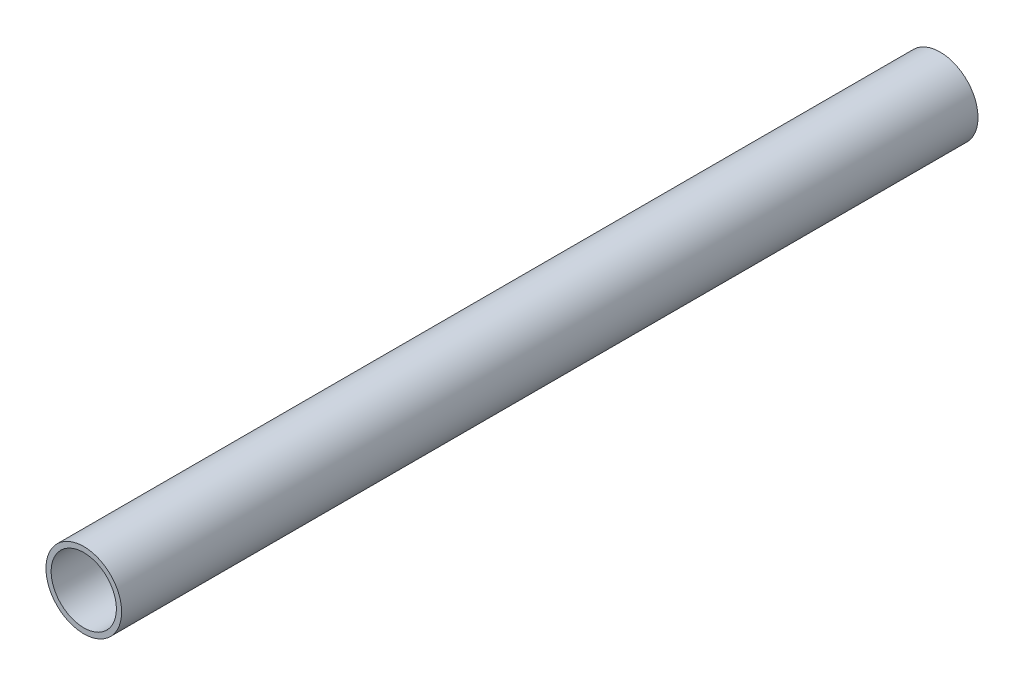
ISO-10303-21;
HEADER;
FILE_DESCRIPTION(('STEP AP214'),'2;1');
FILE_NAME('part.step','',(''),(''),'','','');
FILE_SCHEMA(('AUTOMOTIVE_DESIGN { 1 0 10303 214 1 1 1 1 }'));
ENDSEC;
DATA;
#1=APPLICATION_CONTEXT('core data for automotive mechanical design processes');
#2=APPLICATION_PROTOCOL_DEFINITION('international standard','automotive_design',2000,#1);
#3=PRODUCT_CONTEXT('',#1,'mechanical');
#4=PRODUCT('Part','Part','',(#3));
#5=PRODUCT_RELATED_PRODUCT_CATEGORY('part','',(#4));
#6=PRODUCT_DEFINITION_FORMATION('','',#4);
#7=PRODUCT_DEFINITION_CONTEXT('part definition',#1,'design');
#8=PRODUCT_DEFINITION('design','',#6,#7);
#9=PRODUCT_DEFINITION_SHAPE('','',#8);
#10=(LENGTH_UNIT() NAMED_UNIT(*) SI_UNIT(.MILLI.,.METRE.));
#11=(NAMED_UNIT(*) PLANE_ANGLE_UNIT() SI_UNIT($,.RADIAN.));
#12=(NAMED_UNIT(*) SI_UNIT($,.STERADIAN.) SOLID_ANGLE_UNIT());
#13=UNCERTAINTY_MEASURE_WITH_UNIT(LENGTH_MEASURE(1.E-05),#10,'distance_accuracy_value','');
#14=(GEOMETRIC_REPRESENTATION_CONTEXT(3) GLOBAL_UNCERTAINTY_ASSIGNED_CONTEXT((#13)) GLOBAL_UNIT_ASSIGNED_CONTEXT((#10,
#11,#12)) REPRESENTATION_CONTEXT('',''));
#15=CARTESIAN_POINT('',(0.,0.,0.));
#16=DIRECTION('',(0.,0.,1.));
#17=DIRECTION('',(1.,0.,0.));
#18=AXIS2_PLACEMENT_3D('',#15,#16,#17);
#19=CARTESIAN_POINT('',(0.,0.,101.6));
#20=DIRECTION('',(0.,0.,1.));
#21=DIRECTION('',(1.,0.,0.));
#22=AXIS2_PLACEMENT_3D('',#19,#20,#21);
#23=PLANE('',#22);
#24=CARTESIAN_POINT('',(0.,0.,101.6));
#25=DIRECTION('',(0.,0.,1.));
#26=DIRECTION('',(1.,0.,0.));
#27=AXIS2_PLACEMENT_3D('',#24,#25,#26);
#28=CIRCLE('',#27,4.49);
#29=CARTESIAN_POINT('',(4.49,0.,101.6));
#30=VERTEX_POINT('',#29);
#31=EDGE_CURVE('E10',#30,#30,#28,.T.);
#32=ORIENTED_EDGE('',*,*,#31,.T.);
#33=EDGE_LOOP('',(#32));
#34=FACE_BOUND('',#33,.T.);
#35=CARTESIAN_POINT('',(0.,0.,101.6));
#36=DIRECTION('',(0.,0.,1.));
#37=DIRECTION('',(1.,0.,0.));
#38=AXIS2_PLACEMENT_3D('',#35,#36,#37);
#39=CIRCLE('',#38,3.87);
#40=CARTESIAN_POINT('',(3.87,0.,101.6));
#41=VERTEX_POINT('',#40);
#42=EDGE_CURVE('E45',#41,#41,#39,.T.);
#43=ORIENTED_EDGE('',*,*,#42,.F.);
#44=EDGE_LOOP('',(#43));
#45=FACE_BOUND('',#44,.T.);
#46=ADVANCED_FACE('F34',(#34,#45),#23,.T.);
#47=CARTESIAN_POINT('',(0.,0.,0.));
#48=DIRECTION('',(0.,0.,1.));
#49=DIRECTION('',(1.,0.,0.));
#50=AXIS2_PLACEMENT_3D('',#47,#48,#49);
#51=PLANE('',#50);
#52=CARTESIAN_POINT('',(0.,0.,0.));
#53=DIRECTION('',(0.,0.,1.));
#54=DIRECTION('',(1.,0.,0.));
#55=AXIS2_PLACEMENT_3D('',#52,#53,#54);
#56=CIRCLE('',#55,4.49);
#57=CARTESIAN_POINT('',(4.49,0.,0.));
#58=VERTEX_POINT('',#57);
#59=EDGE_CURVE('E38',#58,#58,#56,.T.);
#60=ORIENTED_EDGE('',*,*,#59,.F.);
#61=EDGE_LOOP('',(#60));
#62=FACE_BOUND('',#61,.T.);
#63=CARTESIAN_POINT('',(0.,0.,0.));
#64=DIRECTION('',(0.,0.,1.));
#65=DIRECTION('',(1.,0.,0.));
#66=AXIS2_PLACEMENT_3D('',#63,#64,#65);
#67=CIRCLE('',#66,3.87);
#68=CARTESIAN_POINT('',(3.87,0.,0.));
#69=VERTEX_POINT('',#68);
#70=EDGE_CURVE('E47',#69,#69,#67,.T.);
#71=ORIENTED_EDGE('',*,*,#70,.T.);
#72=EDGE_LOOP('',(#71));
#73=FACE_BOUND('',#72,.T.);
#74=ADVANCED_FACE('F57',(#62,#73),#51,.F.);
#75=CARTESIAN_POINT('',(0.,0.,101.6));
#76=DIRECTION('',(0.,0.,-1.));
#77=DIRECTION('',(-1.,0.,0.));
#78=AXIS2_PLACEMENT_3D('',#75,#76,#77);
#79=CYLINDRICAL_SURFACE('',#78,4.49);
#80=ORIENTED_EDGE('',*,*,#31,.F.);
#81=EDGE_LOOP('',(#80));
#82=FACE_BOUND('',#81,.T.);
#83=ORIENTED_EDGE('',*,*,#59,.T.);
#84=EDGE_LOOP('',(#83));
#85=FACE_BOUND('',#84,.T.);
#86=ADVANCED_FACE('F36',(#82,#85),#79,.T.);
#87=CARTESIAN_POINT('',(0.,0.,101.6));
#88=DIRECTION('',(0.,0.,-1.));
#89=DIRECTION('',(-1.,0.,0.));
#90=AXIS2_PLACEMENT_3D('',#87,#88,#89);
#91=CYLINDRICAL_SURFACE('',#90,3.87);
#92=ORIENTED_EDGE('',*,*,#42,.T.);
#93=EDGE_LOOP('',(#92));
#94=FACE_BOUND('',#93,.T.);
#95=ORIENTED_EDGE('',*,*,#70,.F.);
#96=EDGE_LOOP('',(#95));
#97=FACE_BOUND('',#96,.T.);
#98=ADVANCED_FACE('F53',(#94,#97),#91,.F.);
#99=CLOSED_SHELL('',(#46,#74,#86,#98));
#100=MANIFOLD_SOLID_BREP('B2',#99);
#101=ADVANCED_BREP_SHAPE_REPRESENTATION('',(#18,#100),#14);
#102=SHAPE_DEFINITION_REPRESENTATION(#9,#101);
ENDSEC;
END-ISO-10303-21;
